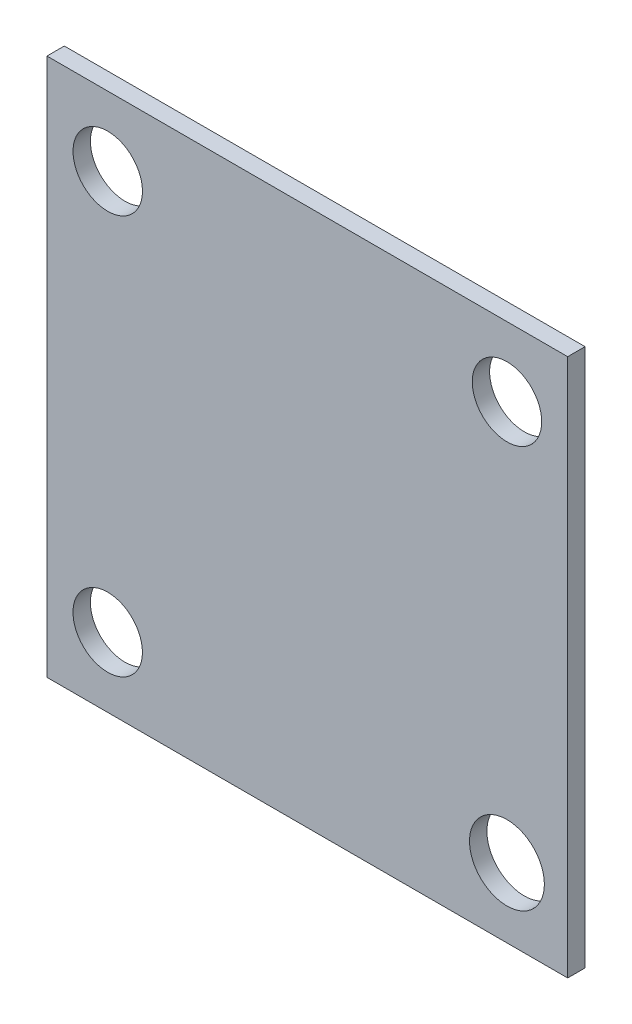
ISO-10303-21;
HEADER;
FILE_DESCRIPTION(('STEP AP214'),'2;1');
FILE_NAME('part.step','',(''),(''),'','','');
FILE_SCHEMA(('AUTOMOTIVE_DESIGN { 1 0 10303 214 1 1 1 1 }'));
ENDSEC;
DATA;
#1=APPLICATION_CONTEXT('core data for automotive mechanical design processes');
#2=APPLICATION_PROTOCOL_DEFINITION('international standard','automotive_design',2000,#1);
#3=PRODUCT_CONTEXT('',#1,'mechanical');
#4=PRODUCT('Part','Part','',(#3));
#5=PRODUCT_RELATED_PRODUCT_CATEGORY('part','',(#4));
#6=PRODUCT_DEFINITION_FORMATION('','',#4);
#7=PRODUCT_DEFINITION_CONTEXT('part definition',#1,'design');
#8=PRODUCT_DEFINITION('design','',#6,#7);
#9=PRODUCT_DEFINITION_SHAPE('','',#8);
#10=(LENGTH_UNIT() NAMED_UNIT(*) SI_UNIT(.MILLI.,.METRE.));
#11=(NAMED_UNIT(*) PLANE_ANGLE_UNIT() SI_UNIT($,.RADIAN.));
#12=(NAMED_UNIT(*) SI_UNIT($,.STERADIAN.) SOLID_ANGLE_UNIT());
#13=UNCERTAINTY_MEASURE_WITH_UNIT(LENGTH_MEASURE(1.E-05),#10,'distance_accuracy_value','');
#14=(GEOMETRIC_REPRESENTATION_CONTEXT(3) GLOBAL_UNCERTAINTY_ASSIGNED_CONTEXT((#13)) GLOBAL_UNIT_ASSIGNED_CONTEXT((#10,
#11,#12)) REPRESENTATION_CONTEXT('',''));
#15=CARTESIAN_POINT('',(0.,0.,0.));
#16=DIRECTION('',(0.,0.,1.));
#17=DIRECTION('',(1.,0.,0.));
#18=AXIS2_PLACEMENT_3D('',#15,#16,#17);
#19=CARTESIAN_POINT('',(0.,0.,1.));
#20=DIRECTION('',(0.,0.,1.));
#21=DIRECTION('',(1.,0.,0.));
#22=AXIS2_PLACEMENT_3D('',#19,#20,#21);
#23=PLANE('',#22);
#24=CARTESIAN_POINT('',(-11.501091744182,-11.4989082558181,1.));
#25=DIRECTION('',(0.,0.,1.));
#26=DIRECTION('',(1.,0.,0.));
#27=AXIS2_PLACEMENT_3D('',#24,#25,#26);
#28=CIRCLE('',#27,2.);
#29=CARTESIAN_POINT('',(-9.50109174418201,-11.4989082558181,1.));
#30=VERTEX_POINT('',#29);
#31=EDGE_CURVE('E142',#30,#30,#28,.T.);
#32=ORIENTED_EDGE('',*,*,#31,.F.);
#33=EDGE_LOOP('',(#32));
#34=FACE_BOUND('',#33,.T.);
#35=CARTESIAN_POINT('',(-11.4989082558179,11.5032752325463,1.));
#36=DIRECTION('',(0.,0.,1.));
#37=DIRECTION('',(1.,0.,0.));
#38=AXIS2_PLACEMENT_3D('',#35,#36,#37);
#39=CIRCLE('',#38,2.);
#40=CARTESIAN_POINT('',(-9.49890825581793,11.5032752325463,1.));
#41=VERTEX_POINT('',#40);
#42=EDGE_CURVE('E112',#41,#41,#39,.T.);
#43=ORIENTED_EDGE('',*,*,#42,.F.);
#44=EDGE_LOOP('',(#43));
#45=FACE_BOUND('',#44,.T.);
#46=DIRECTION('',(0.,1.,0.));
#47=VECTOR('',#46,1.);
#48=CARTESIAN_POINT('',(15.001091744182,-15.5010917441821,1.));
#49=LINE('',#48,#47);
#50=CARTESIAN_POINT('',(15.001091744182,-15.5010917441821,1.));
#51=VERTEX_POINT('',#50);
#52=CARTESIAN_POINT('',(15.001091744182,15.5010917441821,1.));
#53=VERTEX_POINT('',#52);
#54=EDGE_CURVE('E92',#51,#53,#49,.T.);
#55=ORIENTED_EDGE('',*,*,#54,.T.);
#56=DIRECTION('',(-1.,0.,0.));
#57=VECTOR('',#56,1.);
#58=CARTESIAN_POINT('',(15.001091744182,15.5010917441821,1.));
#59=LINE('',#58,#57);
#60=CARTESIAN_POINT('',(-15.001091744182,15.5010917441821,1.));
#61=VERTEX_POINT('',#60);
#62=EDGE_CURVE('E87',#53,#61,#59,.T.);
#63=ORIENTED_EDGE('',*,*,#62,.T.);
#64=DIRECTION('',(0.,-1.,0.));
#65=VECTOR('',#64,1.);
#66=CARTESIAN_POINT('',(-15.001091744182,-15.5010917441821,1.));
#67=LINE('',#66,#65);
#68=CARTESIAN_POINT('',(-15.001091744182,-15.5010917441821,1.));
#69=VERTEX_POINT('',#68);
#70=EDGE_CURVE('E90',#61,#69,#67,.T.);
#71=ORIENTED_EDGE('',*,*,#70,.T.);
#72=DIRECTION('',(1.,0.,0.));
#73=VECTOR('',#72,1.);
#74=CARTESIAN_POINT('',(15.001091744182,-15.5010917441821,1.));
#75=LINE('',#74,#73);
#76=EDGE_CURVE('E57',#69,#51,#75,.T.);
#77=ORIENTED_EDGE('',*,*,#76,.T.);
#78=EDGE_LOOP('',(#55,#63,#71,#77));
#79=FACE_BOUND('',#78,.T.);
#80=CARTESIAN_POINT('',(11.5032752325464,11.5010917441821,1.));
#81=DIRECTION('',(0.,0.,1.));
#82=DIRECTION('',(1.,0.,0.));
#83=AXIS2_PLACEMENT_3D('',#80,#81,#82);
#84=CIRCLE('',#83,2.);
#85=CARTESIAN_POINT('',(13.5032752325464,11.5010917441821,1.));
#86=VERTEX_POINT('',#85);
#87=EDGE_CURVE('E134',#86,#86,#84,.T.);
#88=ORIENTED_EDGE('',*,*,#87,.F.);
#89=EDGE_LOOP('',(#88));
#90=FACE_BOUND('',#89,.T.);
#91=CARTESIAN_POINT('',(11.5010917441823,-11.5010917441821,1.));
#92=DIRECTION('',(0.,0.,1.));
#93=DIRECTION('',(1.,0.,0.));
#94=AXIS2_PLACEMENT_3D('',#91,#92,#93);
#95=CIRCLE('',#94,2.15626689761665);
#96=CARTESIAN_POINT('',(13.657358641799,-11.5010917441821,1.));
#97=VERTEX_POINT('',#96);
#98=EDGE_CURVE('E150',#97,#97,#95,.T.);
#99=ORIENTED_EDGE('',*,*,#98,.F.);
#100=EDGE_LOOP('',(#99));
#101=FACE_BOUND('',#100,.T.);
#102=ADVANCED_FACE('F39',(#34,#45,#79,#90,#101),#23,.T.);
#103=CARTESIAN_POINT('',(0.,0.,0.));
#104=DIRECTION('',(0.,0.,1.));
#105=DIRECTION('',(1.,0.,0.));
#106=AXIS2_PLACEMENT_3D('',#103,#104,#105);
#107=PLANE('',#106);
#108=DIRECTION('',(0.,1.,0.));
#109=VECTOR('',#108,1.);
#110=CARTESIAN_POINT('',(15.001091744182,-15.5010917441821,0.));
#111=LINE('',#110,#109);
#112=CARTESIAN_POINT('',(15.001091744182,-15.5010917441821,0.));
#113=VERTEX_POINT('',#112);
#114=CARTESIAN_POINT('',(15.001091744182,15.5010917441821,0.));
#115=VERTEX_POINT('',#114);
#116=EDGE_CURVE('E108',#113,#115,#111,.T.);
#117=ORIENTED_EDGE('',*,*,#116,.F.);
#118=DIRECTION('',(1.,0.,0.));
#119=VECTOR('',#118,1.);
#120=CARTESIAN_POINT('',(15.001091744182,-15.5010917441821,0.));
#121=LINE('',#120,#119);
#122=CARTESIAN_POINT('',(-15.001091744182,-15.5010917441821,0.));
#123=VERTEX_POINT('',#122);
#124=EDGE_CURVE('E80',#123,#113,#121,.T.);
#125=ORIENTED_EDGE('',*,*,#124,.F.);
#126=DIRECTION('',(0.,-1.,0.));
#127=VECTOR('',#126,1.);
#128=CARTESIAN_POINT('',(-15.001091744182,-15.5010917441821,0.));
#129=LINE('',#128,#127);
#130=CARTESIAN_POINT('',(-15.001091744182,15.5010917441821,0.));
#131=VERTEX_POINT('',#130);
#132=EDGE_CURVE('E74',#131,#123,#129,.T.);
#133=ORIENTED_EDGE('',*,*,#132,.F.);
#134=DIRECTION('',(-1.,0.,0.));
#135=VECTOR('',#134,1.);
#136=CARTESIAN_POINT('',(15.001091744182,15.5010917441821,0.));
#137=LINE('',#136,#135);
#138=EDGE_CURVE('E97',#115,#131,#137,.T.);
#139=ORIENTED_EDGE('',*,*,#138,.F.);
#140=EDGE_LOOP('',(#117,#125,#133,#139));
#141=FACE_BOUND('',#140,.T.);
#142=CARTESIAN_POINT('',(-11.4989082558179,11.5032752325463,0.));
#143=DIRECTION('',(0.,0.,1.));
#144=DIRECTION('',(1.,0.,0.));
#145=AXIS2_PLACEMENT_3D('',#142,#143,#144);
#146=CIRCLE('',#145,2.);
#147=CARTESIAN_POINT('',(-9.49890825581793,11.5032752325463,0.));
#148=VERTEX_POINT('',#147);
#149=EDGE_CURVE('E130',#148,#148,#146,.T.);
#150=ORIENTED_EDGE('',*,*,#149,.T.);
#151=EDGE_LOOP('',(#150));
#152=FACE_BOUND('',#151,.T.);
#153=CARTESIAN_POINT('',(11.5032752325464,11.5010917441821,0.));
#154=DIRECTION('',(0.,0.,1.));
#155=DIRECTION('',(1.,0.,0.));
#156=AXIS2_PLACEMENT_3D('',#153,#154,#155);
#157=CIRCLE('',#156,2.);
#158=CARTESIAN_POINT('',(13.5032752325464,11.5010917441821,0.));
#159=VERTEX_POINT('',#158);
#160=EDGE_CURVE('E138',#159,#159,#157,.T.);
#161=ORIENTED_EDGE('',*,*,#160,.T.);
#162=EDGE_LOOP('',(#161));
#163=FACE_BOUND('',#162,.T.);
#164=CARTESIAN_POINT('',(-11.501091744182,-11.4989082558181,0.));
#165=DIRECTION('',(0.,0.,1.));
#166=DIRECTION('',(1.,0.,0.));
#167=AXIS2_PLACEMENT_3D('',#164,#165,#166);
#168=CIRCLE('',#167,2.);
#169=CARTESIAN_POINT('',(-9.50109174418201,-11.4989082558181,0.));
#170=VERTEX_POINT('',#169);
#171=EDGE_CURVE('E146',#170,#170,#168,.T.);
#172=ORIENTED_EDGE('',*,*,#171,.T.);
#173=EDGE_LOOP('',(#172));
#174=FACE_BOUND('',#173,.T.);
#175=CARTESIAN_POINT('',(11.5010917441823,-11.5010917441821,0.));
#176=DIRECTION('',(0.,0.,1.));
#177=DIRECTION('',(1.,0.,0.));
#178=AXIS2_PLACEMENT_3D('',#175,#176,#177);
#179=CIRCLE('',#178,2.15626689761665);
#180=CARTESIAN_POINT('',(13.657358641799,-11.5010917441821,0.));
#181=VERTEX_POINT('',#180);
#182=EDGE_CURVE('E154',#181,#181,#179,.T.);
#183=ORIENTED_EDGE('',*,*,#182,.T.);
#184=EDGE_LOOP('',(#183));
#185=FACE_BOUND('',#184,.T.);
#186=ADVANCED_FACE('F125',(#141,#152,#163,#174,#185),#107,.F.);
#187=CARTESIAN_POINT('',(15.001091744182,-15.5010917441821,1.));
#188=DIRECTION('',(-1.,0.,0.));
#189=DIRECTION('',(0.,0.,1.));
#190=AXIS2_PLACEMENT_3D('',#187,#188,#189);
#191=PLANE('',#190);
#192=ORIENTED_EDGE('',*,*,#116,.T.);
#193=DIRECTION('',(0.,0.,-1.));
#194=VECTOR('',#193,1.);
#195=CARTESIAN_POINT('',(15.001091744182,15.5010917441821,1.));
#196=LINE('',#195,#194);
#197=EDGE_CURVE('E11',#53,#115,#196,.T.);
#198=ORIENTED_EDGE('',*,*,#197,.F.);
#199=ORIENTED_EDGE('',*,*,#54,.F.);
#200=DIRECTION('',(0.,0.,-1.));
#201=VECTOR('',#200,1.);
#202=CARTESIAN_POINT('',(15.001091744182,-15.5010917441821,1.));
#203=LINE('',#202,#201);
#204=EDGE_CURVE('E104',#51,#113,#203,.T.);
#205=ORIENTED_EDGE('',*,*,#204,.T.);
#206=EDGE_LOOP('',(#192,#198,#199,#205));
#207=FACE_BOUND('',#206,.T.);
#208=ADVANCED_FACE('F41',(#207),#191,.F.);
#209=CARTESIAN_POINT('',(15.001091744182,15.5010917441821,1.));
#210=DIRECTION('',(0.,-1.,0.));
#211=DIRECTION('',(1.,0.,0.));
#212=AXIS2_PLACEMENT_3D('',#209,#210,#211);
#213=PLANE('',#212);
#214=ORIENTED_EDGE('',*,*,#138,.T.);
#215=DIRECTION('',(0.,0.,-1.));
#216=VECTOR('',#215,1.);
#217=CARTESIAN_POINT('',(-15.001091744182,15.5010917441821,1.));
#218=LINE('',#217,#216);
#219=EDGE_CURVE('E49',#61,#131,#218,.T.);
#220=ORIENTED_EDGE('',*,*,#219,.F.);
#221=ORIENTED_EDGE('',*,*,#62,.F.);
#222=ORIENTED_EDGE('',*,*,#197,.T.);
#223=EDGE_LOOP('',(#214,#220,#221,#222));
#224=FACE_BOUND('',#223,.T.);
#225=ADVANCED_FACE('F96',(#224),#213,.F.);
#226=CARTESIAN_POINT('',(-15.001091744182,-15.5010917441821,1.));
#227=DIRECTION('',(1.,0.,0.));
#228=DIRECTION('',(0.,0.,-1.));
#229=AXIS2_PLACEMENT_3D('',#226,#227,#228);
#230=PLANE('',#229);
#231=ORIENTED_EDGE('',*,*,#132,.T.);
#232=DIRECTION('',(0.,0.,-1.));
#233=VECTOR('',#232,1.);
#234=CARTESIAN_POINT('',(-15.001091744182,-15.5010917441821,1.));
#235=LINE('',#234,#233);
#236=EDGE_CURVE('E99',#69,#123,#235,.T.);
#237=ORIENTED_EDGE('',*,*,#236,.F.);
#238=ORIENTED_EDGE('',*,*,#70,.F.);
#239=ORIENTED_EDGE('',*,*,#219,.T.);
#240=EDGE_LOOP('',(#231,#237,#238,#239));
#241=FACE_BOUND('',#240,.T.);
#242=ADVANCED_FACE('F100',(#241),#230,.F.);
#243=CARTESIAN_POINT('',(15.001091744182,-15.5010917441821,1.));
#244=DIRECTION('',(0.,1.,0.));
#245=DIRECTION('',(-1.,0.,0.));
#246=AXIS2_PLACEMENT_3D('',#243,#244,#245);
#247=PLANE('',#246);
#248=ORIENTED_EDGE('',*,*,#124,.T.);
#249=ORIENTED_EDGE('',*,*,#204,.F.);
#250=ORIENTED_EDGE('',*,*,#76,.F.);
#251=ORIENTED_EDGE('',*,*,#236,.T.);
#252=EDGE_LOOP('',(#248,#249,#250,#251));
#253=FACE_BOUND('',#252,.T.);
#254=ADVANCED_FACE('F122',(#253),#247,.F.);
#255=CARTESIAN_POINT('',(-11.4989082558179,11.5032752325463,1.));
#256=DIRECTION('',(0.,0.,-1.));
#257=DIRECTION('',(-1.,0.,0.));
#258=AXIS2_PLACEMENT_3D('',#255,#256,#257);
#259=CYLINDRICAL_SURFACE('',#258,2.);
#260=ORIENTED_EDGE('',*,*,#42,.T.);
#261=EDGE_LOOP('',(#260));
#262=FACE_BOUND('',#261,.T.);
#263=ORIENTED_EDGE('',*,*,#149,.F.);
#264=EDGE_LOOP('',(#263));
#265=FACE_BOUND('',#264,.T.);
#266=ADVANCED_FACE('F175',(#262,#265),#259,.F.);
#267=CARTESIAN_POINT('',(11.5032752325464,11.5010917441821,1.));
#268=DIRECTION('',(0.,0.,-1.));
#269=DIRECTION('',(-1.,0.,0.));
#270=AXIS2_PLACEMENT_3D('',#267,#268,#269);
#271=CYLINDRICAL_SURFACE('',#270,2.);
#272=ORIENTED_EDGE('',*,*,#87,.T.);
#273=EDGE_LOOP('',(#272));
#274=FACE_BOUND('',#273,.T.);
#275=ORIENTED_EDGE('',*,*,#160,.F.);
#276=EDGE_LOOP('',(#275));
#277=FACE_BOUND('',#276,.T.);
#278=ADVANCED_FACE('F221',(#274,#277),#271,.F.);
#279=CARTESIAN_POINT('',(-11.501091744182,-11.4989082558181,1.));
#280=DIRECTION('',(0.,0.,-1.));
#281=DIRECTION('',(-1.,0.,0.));
#282=AXIS2_PLACEMENT_3D('',#279,#280,#281);
#283=CYLINDRICAL_SURFACE('',#282,2.);
#284=ORIENTED_EDGE('',*,*,#31,.T.);
#285=EDGE_LOOP('',(#284));
#286=FACE_BOUND('',#285,.T.);
#287=ORIENTED_EDGE('',*,*,#171,.F.);
#288=EDGE_LOOP('',(#287));
#289=FACE_BOUND('',#288,.T.);
#290=ADVANCED_FACE('F229',(#286,#289),#283,.F.);
#291=CARTESIAN_POINT('',(11.5010917441823,-11.5010917441821,1.));
#292=DIRECTION('',(0.,0.,-1.));
#293=DIRECTION('',(-1.,0.,0.));
#294=AXIS2_PLACEMENT_3D('',#291,#292,#293);
#295=CYLINDRICAL_SURFACE('',#294,2.15626689761665);
#296=ORIENTED_EDGE('',*,*,#98,.T.);
#297=EDGE_LOOP('',(#296));
#298=FACE_BOUND('',#297,.T.);
#299=ORIENTED_EDGE('',*,*,#182,.F.);
#300=EDGE_LOOP('',(#299));
#301=FACE_BOUND('',#300,.T.);
#302=ADVANCED_FACE('F162',(#298,#301),#295,.F.);
#303=CLOSED_SHELL('',(#102,#186,#208,#225,#242,#254,#266,#278,#290,#302));
#304=MANIFOLD_SOLID_BREP('B2',#303);
#305=ADVANCED_BREP_SHAPE_REPRESENTATION('',(#18,#304),#14);
#306=SHAPE_DEFINITION_REPRESENTATION(#9,#305);
ENDSEC;
END-ISO-10303-21;
